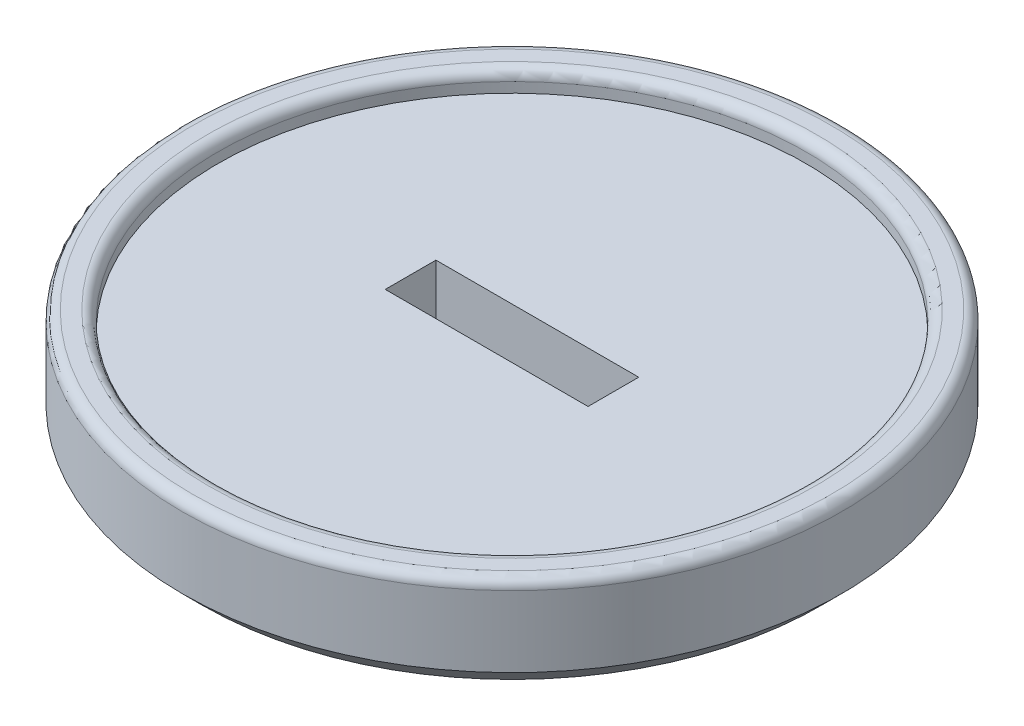
ISO-10303-21;
HEADER;
FILE_DESCRIPTION(('STEP AP214'),'2;1');
FILE_NAME('part.step','',(''),(''),'','','');
FILE_SCHEMA(('AUTOMOTIVE_DESIGN { 1 0 10303 214 1 1 1 1 }'));
ENDSEC;
DATA;
#1=APPLICATION_CONTEXT('core data for automotive mechanical design processes');
#2=APPLICATION_PROTOCOL_DEFINITION('international standard','automotive_design',2000,#1);
#3=PRODUCT_CONTEXT('',#1,'mechanical');
#4=PRODUCT('Part','Part','',(#3));
#5=PRODUCT_RELATED_PRODUCT_CATEGORY('part','',(#4));
#6=PRODUCT_DEFINITION_FORMATION('','',#4);
#7=PRODUCT_DEFINITION_CONTEXT('part definition',#1,'design');
#8=PRODUCT_DEFINITION('design','',#6,#7);
#9=PRODUCT_DEFINITION_SHAPE('','',#8);
#10=(LENGTH_UNIT() NAMED_UNIT(*) SI_UNIT(.MILLI.,.METRE.));
#11=(NAMED_UNIT(*) PLANE_ANGLE_UNIT() SI_UNIT($,.RADIAN.));
#12=(NAMED_UNIT(*) SI_UNIT($,.STERADIAN.) SOLID_ANGLE_UNIT());
#13=UNCERTAINTY_MEASURE_WITH_UNIT(LENGTH_MEASURE(1.E-05),#10,'distance_accuracy_value','');
#14=(GEOMETRIC_REPRESENTATION_CONTEXT(3) GLOBAL_UNCERTAINTY_ASSIGNED_CONTEXT((#13)) GLOBAL_UNIT_ASSIGNED_CONTEXT((#10,
#11,#12)) REPRESENTATION_CONTEXT('',''));
#15=CARTESIAN_POINT('',(0.,0.,0.));
#16=DIRECTION('',(0.,0.,1.));
#17=DIRECTION('',(1.,0.,0.));
#18=AXIS2_PLACEMENT_3D('',#15,#16,#17);
#19=CARTESIAN_POINT('',(10.,-0.000999999999999265,-2.5));
#20=DIRECTION('',(1.,0.,0.));
#21=DIRECTION('',(0.,0.,-1.));
#22=AXIS2_PLACEMENT_3D('',#19,#20,#21);
#23=PLANE('',#22);
#24=DIRECTION('',(0.,0.,1.));
#25=VECTOR('',#24,1.);
#26=CARTESIAN_POINT('',(10.,8.,-2.5));
#27=LINE('',#26,#25);
#28=CARTESIAN_POINT('',(10.,8.,-2.5));
#29=VERTEX_POINT('',#28);
#30=CARTESIAN_POINT('',(10.,8.,2.5));
#31=VERTEX_POINT('',#30);
#32=EDGE_CURVE('E85',#29,#31,#27,.T.);
#33=ORIENTED_EDGE('',*,*,#32,.F.);
#34=DIRECTION('',(0.,1.,0.));
#35=VECTOR('',#34,1.);
#36=CARTESIAN_POINT('',(10.,-0.000999999999999265,-2.5));
#37=LINE('',#36,#35);
#38=CARTESIAN_POINT('',(10.,0.,-2.5));
#39=VERTEX_POINT('',#38);
#40=EDGE_CURVE('E96',#39,#29,#37,.T.);
#41=ORIENTED_EDGE('',*,*,#40,.F.);
#42=DIRECTION('',(0.,0.,1.));
#43=VECTOR('',#42,1.);
#44=CARTESIAN_POINT('',(10.,0.,-2.5));
#45=LINE('',#44,#43);
#46=CARTESIAN_POINT('',(10.,0.,2.5));
#47=VERTEX_POINT('',#46);
#48=EDGE_CURVE('E107',#39,#47,#45,.T.);
#49=ORIENTED_EDGE('',*,*,#48,.T.);
#50=DIRECTION('',(0.,1.,0.));
#51=VECTOR('',#50,1.);
#52=CARTESIAN_POINT('',(10.,-0.000999999999999265,2.5));
#53=LINE('',#52,#51);
#54=EDGE_CURVE('E98',#47,#31,#53,.T.);
#55=ORIENTED_EDGE('',*,*,#54,.T.);
#56=EDGE_LOOP('',(#33,#41,#49,#55));
#57=FACE_BOUND('',#56,.T.);
#58=ADVANCED_FACE('F41',(#57),#23,.F.);
#59=CARTESIAN_POINT('',(-10.,-0.000999999999999265,2.5));
#60=DIRECTION('',(0.,0.,1.));
#61=DIRECTION('',(1.,0.,0.));
#62=AXIS2_PLACEMENT_3D('',#59,#60,#61);
#63=PLANE('',#62);
#64=DIRECTION('',(-1.,0.,0.));
#65=VECTOR('',#64,1.);
#66=CARTESIAN_POINT('',(-10.,8.,2.5));
#67=LINE('',#66,#65);
#68=CARTESIAN_POINT('',(-10.,8.,2.5));
#69=VERTEX_POINT('',#68);
#70=EDGE_CURVE('E100',#31,#69,#67,.T.);
#71=ORIENTED_EDGE('',*,*,#70,.F.);
#72=ORIENTED_EDGE('',*,*,#54,.F.);
#73=DIRECTION('',(-1.,0.,0.));
#74=VECTOR('',#73,1.);
#75=CARTESIAN_POINT('',(-10.,0.,2.5));
#76=LINE('',#75,#74);
#77=CARTESIAN_POINT('',(-10.,0.,2.5));
#78=VERTEX_POINT('',#77);
#79=EDGE_CURVE('E113',#47,#78,#76,.T.);
#80=ORIENTED_EDGE('',*,*,#79,.T.);
#81=DIRECTION('',(0.,1.,0.));
#82=VECTOR('',#81,1.);
#83=CARTESIAN_POINT('',(-10.,-0.000999999999999265,2.5));
#84=LINE('',#83,#82);
#85=EDGE_CURVE('E111',#78,#69,#84,.T.);
#86=ORIENTED_EDGE('',*,*,#85,.T.);
#87=EDGE_LOOP('',(#71,#72,#80,#86));
#88=FACE_BOUND('',#87,.T.);
#89=ADVANCED_FACE('F150',(#88),#63,.F.);
#90=CARTESIAN_POINT('',(-10.,-0.000999999999999265,-2.5));
#91=DIRECTION('',(-1.,0.,0.));
#92=DIRECTION('',(0.,0.,1.));
#93=AXIS2_PLACEMENT_3D('',#90,#91,#92);
#94=PLANE('',#93);
#95=DIRECTION('',(0.,0.,-1.));
#96=VECTOR('',#95,1.);
#97=CARTESIAN_POINT('',(-10.,8.,-2.5));
#98=LINE('',#97,#96);
#99=CARTESIAN_POINT('',(-10.,8.,-2.5));
#100=VERTEX_POINT('',#99);
#101=EDGE_CURVE('E58',#69,#100,#98,.T.);
#102=ORIENTED_EDGE('',*,*,#101,.F.);
#103=ORIENTED_EDGE('',*,*,#85,.F.);
#104=DIRECTION('',(0.,0.,-1.));
#105=VECTOR('',#104,1.);
#106=CARTESIAN_POINT('',(-10.,0.,-2.5));
#107=LINE('',#106,#105);
#108=CARTESIAN_POINT('',(-10.,0.,-2.5));
#109=VERTEX_POINT('',#108);
#110=EDGE_CURVE('E66',#78,#109,#107,.T.);
#111=ORIENTED_EDGE('',*,*,#110,.T.);
#112=DIRECTION('',(0.,1.,0.));
#113=VECTOR('',#112,1.);
#114=CARTESIAN_POINT('',(-10.,-0.000999999999999265,-2.5));
#115=LINE('',#114,#113);
#116=EDGE_CURVE('E106',#109,#100,#115,.T.);
#117=ORIENTED_EDGE('',*,*,#116,.T.);
#118=EDGE_LOOP('',(#102,#103,#111,#117));
#119=FACE_BOUND('',#118,.T.);
#120=ADVANCED_FACE('F155',(#119),#94,.F.);
#121=CARTESIAN_POINT('',(-10.,-0.000999999999999265,-2.5));
#122=DIRECTION('',(0.,0.,-1.));
#123=DIRECTION('',(-1.,0.,0.));
#124=AXIS2_PLACEMENT_3D('',#121,#122,#123);
#125=PLANE('',#124);
#126=DIRECTION('',(1.,0.,0.));
#127=VECTOR('',#126,1.);
#128=CARTESIAN_POINT('',(-10.,8.,-2.5));
#129=LINE('',#128,#127);
#130=EDGE_CURVE('E82',#100,#29,#129,.T.);
#131=ORIENTED_EDGE('',*,*,#130,.F.);
#132=ORIENTED_EDGE('',*,*,#116,.F.);
#133=DIRECTION('',(1.,0.,0.));
#134=VECTOR('',#133,1.);
#135=CARTESIAN_POINT('',(-10.,0.,-2.5));
#136=LINE('',#135,#134);
#137=EDGE_CURVE('E91',#109,#39,#136,.T.);
#138=ORIENTED_EDGE('',*,*,#137,.T.);
#139=ORIENTED_EDGE('',*,*,#40,.T.);
#140=EDGE_LOOP('',(#131,#132,#138,#139));
#141=FACE_BOUND('',#140,.T.);
#142=ADVANCED_FACE('F102',(#141),#125,.F.);
#143=CARTESIAN_POINT('',(0.,10.,0.));
#144=DIRECTION('',(0.,-1.,0.));
#145=DIRECTION('',(0.,0.,-1.));
#146=AXIS2_PLACEMENT_3D('',#143,#144,#145);
#147=CYLINDRICAL_SURFACE('',#146,32.5);
#148=CARTESIAN_POINT('',(0.,2.,0.));
#149=DIRECTION('',(0.,1.,0.));
#150=DIRECTION('',(0.,0.,1.));
#151=AXIS2_PLACEMENT_3D('',#148,#149,#150);
#152=CIRCLE('',#151,32.5);
#153=CARTESIAN_POINT('',(0.,2.,32.5));
#154=VERTEX_POINT('',#153);
#155=EDGE_CURVE('E51',#154,#154,#152,.T.);
#156=ORIENTED_EDGE('',*,*,#155,.T.);
#157=EDGE_LOOP('',(#156));
#158=FACE_BOUND('',#157,.T.);
#159=CARTESIAN_POINT('',(0.,9.,0.));
#160=DIRECTION('',(0.,1.,0.));
#161=DIRECTION('',(0.,0.,1.));
#162=AXIS2_PLACEMENT_3D('',#159,#160,#161);
#163=CIRCLE('',#162,32.5);
#164=CARTESIAN_POINT('',(0.,9.,32.5));
#165=VERTEX_POINT('',#164);
#166=EDGE_CURVE('E122',#165,#165,#163,.F.);
#167=ORIENTED_EDGE('',*,*,#166,.T.);
#168=EDGE_LOOP('',(#167));
#169=FACE_BOUND('',#168,.T.);
#170=ADVANCED_FACE('F137',(#158,#169),#147,.T.);
#171=CARTESIAN_POINT('',(0.,10.,0.));
#172=DIRECTION('',(0.,1.,0.));
#173=DIRECTION('',(0.,0.,1.));
#174=AXIS2_PLACEMENT_3D('',#171,#172,#173);
#175=PLANE('',#174);
#176=CARTESIAN_POINT('',(0.,10.,0.));
#177=DIRECTION('',(0.,1.,0.));
#178=DIRECTION('',(0.,0.,1.));
#179=AXIS2_PLACEMENT_3D('',#176,#177,#178);
#180=CIRCLE('',#179,30.);
#181=CARTESIAN_POINT('',(0.,10.,30.));
#182=VERTEX_POINT('',#181);
#183=EDGE_CURVE('E130',#182,#182,#180,.F.);
#184=ORIENTED_EDGE('',*,*,#183,.T.);
#185=EDGE_LOOP('',(#184));
#186=FACE_BOUND('',#185,.T.);
#187=CARTESIAN_POINT('',(0.,10.,0.));
#188=DIRECTION('',(0.,1.,0.));
#189=DIRECTION('',(0.,0.,1.));
#190=AXIS2_PLACEMENT_3D('',#187,#188,#189);
#191=CIRCLE('',#190,31.5);
#192=CARTESIAN_POINT('',(0.,10.,31.5));
#193=VERTEX_POINT('',#192);
#194=EDGE_CURVE('E90',#193,#193,#191,.T.);
#195=ORIENTED_EDGE('',*,*,#194,.T.);
#196=EDGE_LOOP('',(#195));
#197=FACE_BOUND('',#196,.T.);
#198=ADVANCED_FACE('F161',(#186,#197),#175,.T.);
#199=CARTESIAN_POINT('',(0.,0.,0.));
#200=DIRECTION('',(0.,1.,0.));
#201=DIRECTION('',(0.,0.,1.));
#202=AXIS2_PLACEMENT_3D('',#199,#200,#201);
#203=PLANE('',#202);
#204=CARTESIAN_POINT('',(0.,0.,0.));
#205=DIRECTION('',(0.,1.,0.));
#206=DIRECTION('',(0.,0.,1.));
#207=AXIS2_PLACEMENT_3D('',#204,#205,#206);
#208=CIRCLE('',#207,30.5);
#209=CARTESIAN_POINT('',(0.,0.,30.5));
#210=VERTEX_POINT('',#209);
#211=EDGE_CURVE('E11',#210,#210,#208,.F.);
#212=ORIENTED_EDGE('',*,*,#211,.T.);
#213=EDGE_LOOP('',(#212));
#214=FACE_BOUND('',#213,.T.);
#215=ORIENTED_EDGE('',*,*,#79,.F.);
#216=ORIENTED_EDGE('',*,*,#48,.F.);
#217=ORIENTED_EDGE('',*,*,#137,.F.);
#218=ORIENTED_EDGE('',*,*,#110,.F.);
#219=EDGE_LOOP('',(#215,#216,#217,#218));
#220=FACE_BOUND('',#219,.T.);
#221=ADVANCED_FACE('F164',(#214,#220),#203,.F.);
#222=CARTESIAN_POINT('',(0.,8.,0.));
#223=DIRECTION('',(0.,1.,0.));
#224=DIRECTION('',(0.,0.,1.));
#225=AXIS2_PLACEMENT_3D('',#222,#223,#224);
#226=PLANE('',#225);
#227=CARTESIAN_POINT('',(0.,8.,0.));
#228=DIRECTION('',(0.,1.,0.));
#229=DIRECTION('',(0.,0.,1.));
#230=AXIS2_PLACEMENT_3D('',#227,#228,#229);
#231=CIRCLE('',#230,29.);
#232=CARTESIAN_POINT('',(0.,8.,29.));
#233=VERTEX_POINT('',#232);
#234=EDGE_CURVE('E196',#233,#233,#231,.T.);
#235=ORIENTED_EDGE('',*,*,#234,.T.);
#236=EDGE_LOOP('',(#235));
#237=FACE_BOUND('',#236,.T.);
#238=ORIENTED_EDGE('',*,*,#32,.T.);
#239=ORIENTED_EDGE('',*,*,#70,.T.);
#240=ORIENTED_EDGE('',*,*,#101,.T.);
#241=ORIENTED_EDGE('',*,*,#130,.T.);
#242=EDGE_LOOP('',(#238,#239,#240,#241));
#243=FACE_BOUND('',#242,.T.);
#244=ADVANCED_FACE('F84',(#237,#243),#226,.T.);
#245=CARTESIAN_POINT('',(0.,8.,0.));
#246=DIRECTION('',(0.,1.,0.));
#247=DIRECTION('',(0.,0.,1.));
#248=AXIS2_PLACEMENT_3D('',#245,#246,#247);
#249=CYLINDRICAL_SURFACE('',#248,29.);
#250=CARTESIAN_POINT('',(0.,9.,0.));
#251=DIRECTION('',(0.,1.,0.));
#252=DIRECTION('',(0.,0.,1.));
#253=AXIS2_PLACEMENT_3D('',#250,#251,#252);
#254=CIRCLE('',#253,29.);
#255=CARTESIAN_POINT('',(0.,9.,29.));
#256=VERTEX_POINT('',#255);
#257=EDGE_CURVE('E126',#256,#256,#254,.T.);
#258=ORIENTED_EDGE('',*,*,#257,.T.);
#259=EDGE_LOOP('',(#258));
#260=FACE_BOUND('',#259,.T.);
#261=ORIENTED_EDGE('',*,*,#234,.F.);
#262=EDGE_LOOP('',(#261));
#263=FACE_BOUND('',#262,.T.);
#264=ADVANCED_FACE('F172',(#260,#263),#249,.F.);
#265=CARTESIAN_POINT('',(0.,9.,0.));
#266=DIRECTION('',(0.,1.,0.));
#267=DIRECTION('',(0.,0.,1.));
#268=AXIS2_PLACEMENT_3D('',#265,#266,#267);
#269=TOROIDAL_SURFACE('',#268,31.5,1.);
#270=ORIENTED_EDGE('',*,*,#166,.F.);
#271=EDGE_LOOP('',(#270));
#272=FACE_BOUND('',#271,.T.);
#273=ORIENTED_EDGE('',*,*,#194,.F.);
#274=EDGE_LOOP('',(#273));
#275=FACE_BOUND('',#274,.T.);
#276=ADVANCED_FACE('F146',(#272,#275),#269,.T.);
#277=CARTESIAN_POINT('',(0.,9.,0.));
#278=DIRECTION('',(0.,1.,0.));
#279=DIRECTION('',(0.,0.,1.));
#280=AXIS2_PLACEMENT_3D('',#277,#278,#279);
#281=TOROIDAL_SURFACE('',#280,30.,1.);
#282=ORIENTED_EDGE('',*,*,#183,.F.);
#283=EDGE_LOOP('',(#282));
#284=FACE_BOUND('',#283,.T.);
#285=ORIENTED_EDGE('',*,*,#257,.F.);
#286=EDGE_LOOP('',(#285));
#287=FACE_BOUND('',#286,.T.);
#288=ADVANCED_FACE('F141',(#284,#287),#281,.T.);
#289=CARTESIAN_POINT('',(0.,2.,0.));
#290=DIRECTION('',(0.,1.,0.));
#291=DIRECTION('',(0.,0.,1.));
#292=AXIS2_PLACEMENT_3D('',#289,#290,#291);
#293=CONICAL_SURFACE('',#292,32.5,0.78539816339745);
#294=ORIENTED_EDGE('',*,*,#211,.F.);
#295=EDGE_LOOP('',(#294));
#296=FACE_BOUND('',#295,.T.);
#297=ORIENTED_EDGE('',*,*,#155,.F.);
#298=EDGE_LOOP('',(#297));
#299=FACE_BOUND('',#298,.T.);
#300=ADVANCED_FACE('F44',(#296,#299),#293,.T.);
#301=CLOSED_SHELL('',(#58,#89,#120,#142,#170,#198,#221,#244,#264,#276,#288,#300));
#302=MANIFOLD_SOLID_BREP('B2',#301);
#303=ADVANCED_BREP_SHAPE_REPRESENTATION('',(#18,#302),#14);
#304=SHAPE_DEFINITION_REPRESENTATION(#9,#303);
ENDSEC;
END-ISO-10303-21;
